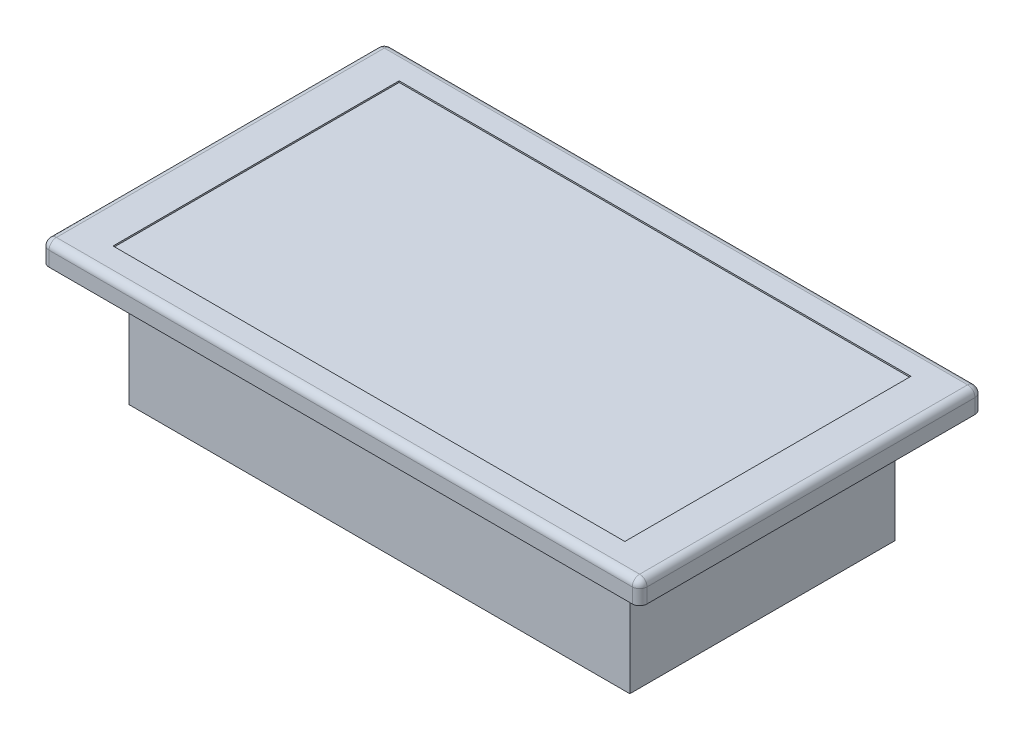
ISO-10303-21;
HEADER;
FILE_DESCRIPTION(('STEP AP214'),'2;1');
FILE_NAME('part.step','',(''),(''),'','','');
FILE_SCHEMA(('AUTOMOTIVE_DESIGN { 1 0 10303 214 1 1 1 1 }'));
ENDSEC;
DATA;
#1=APPLICATION_CONTEXT('core data for automotive mechanical design processes');
#2=APPLICATION_PROTOCOL_DEFINITION('international standard','automotive_design',2000,#1);
#3=PRODUCT_CONTEXT('',#1,'mechanical');
#4=PRODUCT('Part','Part','',(#3));
#5=PRODUCT_RELATED_PRODUCT_CATEGORY('part','',(#4));
#6=PRODUCT_DEFINITION_FORMATION('','',#4);
#7=PRODUCT_DEFINITION_CONTEXT('part definition',#1,'design');
#8=PRODUCT_DEFINITION('design','',#6,#7);
#9=PRODUCT_DEFINITION_SHAPE('','',#8);
#10=(LENGTH_UNIT() NAMED_UNIT(*) SI_UNIT(.MILLI.,.METRE.));
#11=(NAMED_UNIT(*) PLANE_ANGLE_UNIT() SI_UNIT($,.RADIAN.));
#12=(NAMED_UNIT(*) SI_UNIT($,.STERADIAN.) SOLID_ANGLE_UNIT());
#13=UNCERTAINTY_MEASURE_WITH_UNIT(LENGTH_MEASURE(1.E-05),#10,'distance_accuracy_value','');
#14=(GEOMETRIC_REPRESENTATION_CONTEXT(3) GLOBAL_UNCERTAINTY_ASSIGNED_CONTEXT((#13)) GLOBAL_UNIT_ASSIGNED_CONTEXT((#10,
#11,#12)) REPRESENTATION_CONTEXT('',''));
#15=CARTESIAN_POINT('',(0.,0.,0.));
#16=DIRECTION('',(0.,0.,1.));
#17=DIRECTION('',(1.,0.,0.));
#18=AXIS2_PLACEMENT_3D('',#15,#16,#17);
#19=CARTESIAN_POINT('',(43.18,20.32,22.86));
#20=DIRECTION('',(-1.,0.,0.));
#21=DIRECTION('',(0.,0.,1.));
#22=AXIS2_PLACEMENT_3D('',#19,#20,#21);
#23=PLANE('',#22);
#24=DIRECTION('',(0.,0.,-1.));
#25=VECTOR('',#24,1.);
#26=CARTESIAN_POINT('',(43.18,0.,22.86));
#27=LINE('',#26,#25);
#28=CARTESIAN_POINT('',(43.18,0.,22.86));
#29=VERTEX_POINT('',#28);
#30=CARTESIAN_POINT('',(43.18,0.,-22.86));
#31=VERTEX_POINT('',#30);
#32=EDGE_CURVE('E263',#29,#31,#27,.T.);
#33=ORIENTED_EDGE('',*,*,#32,.T.);
#34=DIRECTION('',(0.,-1.,0.));
#35=VECTOR('',#34,1.);
#36=CARTESIAN_POINT('',(43.18,20.32,-22.86));
#37=LINE('',#36,#35);
#38=CARTESIAN_POINT('',(43.18,20.32,-22.86));
#39=VERTEX_POINT('',#38);
#40=EDGE_CURVE('E300',#39,#31,#37,.T.);
#41=ORIENTED_EDGE('',*,*,#40,.F.);
#42=DIRECTION('',(0.,0.,-1.));
#43=VECTOR('',#42,1.);
#44=CARTESIAN_POINT('',(43.18,20.32,22.86));
#45=LINE('',#44,#43);
#46=CARTESIAN_POINT('',(43.18,20.32,22.86));
#47=VERTEX_POINT('',#46);
#48=EDGE_CURVE('E269',#47,#39,#45,.T.);
#49=ORIENTED_EDGE('',*,*,#48,.F.);
#50=DIRECTION('',(0.,-1.,0.));
#51=VECTOR('',#50,1.);
#52=CARTESIAN_POINT('',(43.18,20.32,22.86));
#53=LINE('',#52,#51);
#54=EDGE_CURVE('E282',#47,#29,#53,.T.);
#55=ORIENTED_EDGE('',*,*,#54,.T.);
#56=EDGE_LOOP('',(#33,#41,#49,#55));
#57=FACE_BOUND('',#56,.T.);
#58=ADVANCED_FACE('F37',(#57),#23,.F.);
#59=CARTESIAN_POINT('',(-43.18,20.32,-22.86));
#60=DIRECTION('',(0.,0.,1.));
#61=DIRECTION('',(1.,0.,0.));
#62=AXIS2_PLACEMENT_3D('',#59,#60,#61);
#63=PLANE('',#62);
#64=DIRECTION('',(-1.,0.,0.));
#65=VECTOR('',#64,1.);
#66=CARTESIAN_POINT('',(-43.18,0.,-22.86));
#67=LINE('',#66,#65);
#68=CARTESIAN_POINT('',(-43.18,0.,-22.86));
#69=VERTEX_POINT('',#68);
#70=EDGE_CURVE('E285',#31,#69,#67,.T.);
#71=ORIENTED_EDGE('',*,*,#70,.T.);
#72=DIRECTION('',(0.,-1.,0.));
#73=VECTOR('',#72,1.);
#74=CARTESIAN_POINT('',(-43.18,20.32,-22.86));
#75=LINE('',#74,#73);
#76=CARTESIAN_POINT('',(-43.18,20.32,-22.86));
#77=VERTEX_POINT('',#76);
#78=EDGE_CURVE('E297',#77,#69,#75,.T.);
#79=ORIENTED_EDGE('',*,*,#78,.F.);
#80=DIRECTION('',(-1.,0.,0.));
#81=VECTOR('',#80,1.);
#82=CARTESIAN_POINT('',(-43.18,20.32,-22.86));
#83=LINE('',#82,#81);
#84=EDGE_CURVE('E272',#39,#77,#83,.T.);
#85=ORIENTED_EDGE('',*,*,#84,.F.);
#86=ORIENTED_EDGE('',*,*,#40,.T.);
#87=EDGE_LOOP('',(#71,#79,#85,#86));
#88=FACE_BOUND('',#87,.T.);
#89=ADVANCED_FACE('F446',(#88),#63,.F.);
#90=CARTESIAN_POINT('',(-43.18,20.32,22.86));
#91=DIRECTION('',(1.,0.,0.));
#92=DIRECTION('',(0.,0.,-1.));
#93=AXIS2_PLACEMENT_3D('',#90,#91,#92);
#94=PLANE('',#93);
#95=DIRECTION('',(0.,0.,-1.));
#96=VECTOR('',#95,1.);
#97=CARTESIAN_POINT('',(-43.18,15.494,12.4701996636531));
#98=LINE('',#97,#96);
#99=CARTESIAN_POINT('',(-43.18,15.494,12.4701996636531));
#100=VERTEX_POINT('',#99);
#101=CARTESIAN_POINT('',(-43.18,15.494,-13.3410539706276));
#102=VERTEX_POINT('',#101);
#103=EDGE_CURVE('E240',#100,#102,#98,.T.);
#104=ORIENTED_EDGE('',*,*,#103,.F.);
#105=DIRECTION('',(0.,-1.,0.));
#106=VECTOR('',#105,1.);
#107=CARTESIAN_POINT('',(-43.18,15.494,12.4701996636531));
#108=LINE('',#107,#106);
#109=CARTESIAN_POINT('',(-43.18,0.,12.4701996636531));
#110=VERTEX_POINT('',#109);
#111=EDGE_CURVE('E260',#100,#110,#108,.T.);
#112=ORIENTED_EDGE('',*,*,#111,.T.);
#113=DIRECTION('',(0.,0.,1.));
#114=VECTOR('',#113,1.);
#115=CARTESIAN_POINT('',(-43.18,0.,22.86));
#116=LINE('',#115,#114);
#117=CARTESIAN_POINT('',(-43.18,0.,22.86));
#118=VERTEX_POINT('',#117);
#119=EDGE_CURVE('E287',#110,#118,#116,.T.);
#120=ORIENTED_EDGE('',*,*,#119,.T.);
#121=DIRECTION('',(0.,-1.,0.));
#122=VECTOR('',#121,1.);
#123=CARTESIAN_POINT('',(-43.18,20.32,22.86));
#124=LINE('',#123,#122);
#125=CARTESIAN_POINT('',(-43.18,20.32,22.86));
#126=VERTEX_POINT('',#125);
#127=EDGE_CURVE('E294',#126,#118,#124,.T.);
#128=ORIENTED_EDGE('',*,*,#127,.F.);
#129=DIRECTION('',(0.,0.,1.));
#130=VECTOR('',#129,1.);
#131=CARTESIAN_POINT('',(-43.18,20.32,22.86));
#132=LINE('',#131,#130);
#133=EDGE_CURVE('E276',#77,#126,#132,.T.);
#134=ORIENTED_EDGE('',*,*,#133,.F.);
#135=ORIENTED_EDGE('',*,*,#78,.T.);
#136=CARTESIAN_POINT('',(-43.18,0.,-13.3410539706276));
#137=VERTEX_POINT('',#136);
#138=EDGE_CURVE('E288',#69,#137,#116,.T.);
#139=ORIENTED_EDGE('',*,*,#138,.T.);
#140=DIRECTION('',(0.,-1.,0.));
#141=VECTOR('',#140,1.);
#142=CARTESIAN_POINT('',(-43.18,15.494,-13.3410539706276));
#143=LINE('',#142,#141);
#144=EDGE_CURVE('E253',#102,#137,#143,.T.);
#145=ORIENTED_EDGE('',*,*,#144,.F.);
#146=EDGE_LOOP('',(#104,#112,#120,#128,#134,#135,#139,#145));
#147=FACE_BOUND('',#146,.T.);
#148=ADVANCED_FACE('F452',(#147),#94,.F.);
#149=CARTESIAN_POINT('',(-43.18,20.32,22.86));
#150=DIRECTION('',(0.,0.,-1.));
#151=DIRECTION('',(-1.,0.,0.));
#152=AXIS2_PLACEMENT_3D('',#149,#150,#151);
#153=PLANE('',#152);
#154=DIRECTION('',(1.,0.,0.));
#155=VECTOR('',#154,1.);
#156=CARTESIAN_POINT('',(-43.18,0.,22.86));
#157=LINE('',#156,#155);
#158=EDGE_CURVE('E273',#118,#29,#157,.T.);
#159=ORIENTED_EDGE('',*,*,#158,.T.);
#160=ORIENTED_EDGE('',*,*,#54,.F.);
#161=DIRECTION('',(1.,0.,0.));
#162=VECTOR('',#161,1.);
#163=CARTESIAN_POINT('',(-43.18,20.32,22.86));
#164=LINE('',#163,#162);
#165=EDGE_CURVE('E279',#126,#47,#164,.T.);
#166=ORIENTED_EDGE('',*,*,#165,.F.);
#167=ORIENTED_EDGE('',*,*,#127,.T.);
#168=EDGE_LOOP('',(#159,#160,#166,#167));
#169=FACE_BOUND('',#168,.T.);
#170=ADVANCED_FACE('F583',(#169),#153,.F.);
#171=CARTESIAN_POINT('',(0.,0.,0.));
#172=DIRECTION('',(0.,-1.,0.));
#173=DIRECTION('',(0.,0.,-1.));
#174=AXIS2_PLACEMENT_3D('',#171,#172,#173);
#175=PLANE('',#174);
#176=DIRECTION('',(-1.,0.,0.));
#177=VECTOR('',#176,1.);
#178=CARTESIAN_POINT('',(-43.18,0.,12.4701996636531));
#179=LINE('',#178,#177);
#180=CARTESIAN_POINT('',(-29.9886261607867,0.,12.4701996636531));
#181=VERTEX_POINT('',#180);
#182=EDGE_CURVE('E244',#181,#110,#179,.T.);
#183=ORIENTED_EDGE('',*,*,#182,.F.);
#184=DIRECTION('',(0.,0.,1.));
#185=VECTOR('',#184,1.);
#186=CARTESIAN_POINT('',(-29.9886261607867,0.,12.4701996636531));
#187=LINE('',#186,#185);
#188=CARTESIAN_POINT('',(-29.9886261607867,0.,-13.3410539706276));
#189=VERTEX_POINT('',#188);
#190=EDGE_CURVE('E256',#189,#181,#187,.T.);
#191=ORIENTED_EDGE('',*,*,#190,.F.);
#192=DIRECTION('',(1.,0.,0.));
#193=VECTOR('',#192,1.);
#194=CARTESIAN_POINT('',(-43.18,0.,-13.3410539706276));
#195=LINE('',#194,#193);
#196=EDGE_CURVE('E239',#137,#189,#195,.T.);
#197=ORIENTED_EDGE('',*,*,#196,.F.);
#198=ORIENTED_EDGE('',*,*,#138,.F.);
#199=ORIENTED_EDGE('',*,*,#70,.F.);
#200=ORIENTED_EDGE('',*,*,#32,.F.);
#201=ORIENTED_EDGE('',*,*,#158,.F.);
#202=ORIENTED_EDGE('',*,*,#119,.F.);
#203=EDGE_LOOP('',(#183,#191,#197,#198,#199,#200,#201,#202));
#204=FACE_BOUND('',#203,.T.);
#205=ADVANCED_FACE('F573',(#204),#175,.T.);
#206=CARTESIAN_POINT('',(-43.18,15.494,12.4701996636531));
#207=DIRECTION('',(0.,0.,1.));
#208=DIRECTION('',(1.,0.,0.));
#209=AXIS2_PLACEMENT_3D('',#206,#207,#208);
#210=PLANE('',#209);
#211=ORIENTED_EDGE('',*,*,#182,.T.);
#212=ORIENTED_EDGE('',*,*,#111,.F.);
#213=DIRECTION('',(-1.,0.,0.));
#214=VECTOR('',#213,1.);
#215=CARTESIAN_POINT('',(-43.18,15.494,12.4701996636531));
#216=LINE('',#215,#214);
#217=CARTESIAN_POINT('',(-29.9886261607867,15.494,12.4701996636531));
#218=VERTEX_POINT('',#217);
#219=EDGE_CURVE('E250',#218,#100,#216,.T.);
#220=ORIENTED_EDGE('',*,*,#219,.F.);
#221=DIRECTION('',(0.,-1.,0.));
#222=VECTOR('',#221,1.);
#223=CARTESIAN_POINT('',(-29.9886261607867,15.494,12.4701996636531));
#224=LINE('',#223,#222);
#225=EDGE_CURVE('E264',#218,#181,#224,.T.);
#226=ORIENTED_EDGE('',*,*,#225,.T.);
#227=EDGE_LOOP('',(#211,#212,#220,#226));
#228=FACE_BOUND('',#227,.T.);
#229=ADVANCED_FACE('F569',(#228),#210,.F.);
#230=CARTESIAN_POINT('',(-29.9886261607867,15.494,12.4701996636531));
#231=DIRECTION('',(1.,0.,0.));
#232=DIRECTION('',(0.,0.,-1.));
#233=AXIS2_PLACEMENT_3D('',#230,#231,#232);
#234=PLANE('',#233);
#235=ORIENTED_EDGE('',*,*,#190,.T.);
#236=ORIENTED_EDGE('',*,*,#225,.F.);
#237=DIRECTION('',(0.,0.,1.));
#238=VECTOR('',#237,1.);
#239=CARTESIAN_POINT('',(-29.9886261607867,15.494,12.4701996636531));
#240=LINE('',#239,#238);
#241=CARTESIAN_POINT('',(-29.9886261607867,15.494,-13.3410539706276));
#242=VERTEX_POINT('',#241);
#243=EDGE_CURVE('E247',#242,#218,#240,.T.);
#244=ORIENTED_EDGE('',*,*,#243,.F.);
#245=DIRECTION('',(0.,-1.,0.));
#246=VECTOR('',#245,1.);
#247=CARTESIAN_POINT('',(-29.9886261607867,15.494,-13.3410539706276));
#248=LINE('',#247,#246);
#249=EDGE_CURVE('E266',#242,#189,#248,.T.);
#250=ORIENTED_EDGE('',*,*,#249,.T.);
#251=EDGE_LOOP('',(#235,#236,#244,#250));
#252=FACE_BOUND('',#251,.T.);
#253=ADVANCED_FACE('F572',(#252),#234,.F.);
#254=CARTESIAN_POINT('',(-43.18,15.494,-13.3410539706276));
#255=DIRECTION('',(0.,0.,-1.));
#256=DIRECTION('',(-1.,0.,0.));
#257=AXIS2_PLACEMENT_3D('',#254,#255,#256);
#258=PLANE('',#257);
#259=ORIENTED_EDGE('',*,*,#196,.T.);
#260=ORIENTED_EDGE('',*,*,#249,.F.);
#261=DIRECTION('',(1.,0.,0.));
#262=VECTOR('',#261,1.);
#263=CARTESIAN_POINT('',(-43.18,15.494,-13.3410539706276));
#264=LINE('',#263,#262);
#265=EDGE_CURVE('E243',#102,#242,#264,.T.);
#266=ORIENTED_EDGE('',*,*,#265,.F.);
#267=ORIENTED_EDGE('',*,*,#144,.T.);
#268=EDGE_LOOP('',(#259,#260,#266,#267));
#269=FACE_BOUND('',#268,.T.);
#270=ADVANCED_FACE('F567',(#269),#258,.F.);
#271=CARTESIAN_POINT('',(0.,15.494,0.));
#272=DIRECTION('',(0.,-1.,0.));
#273=DIRECTION('',(0.,0.,-1.));
#274=AXIS2_PLACEMENT_3D('',#271,#272,#273);
#275=PLANE('',#274);
#276=ORIENTED_EDGE('',*,*,#103,.T.);
#277=ORIENTED_EDGE('',*,*,#265,.T.);
#278=ORIENTED_EDGE('',*,*,#243,.T.);
#279=ORIENTED_EDGE('',*,*,#219,.T.);
#280=EDGE_LOOP('',(#276,#277,#278,#279));
#281=FACE_BOUND('',#280,.T.);
#282=ADVANCED_FACE('F556',(#281),#275,.T.);
#283=CARTESIAN_POINT('',(0.,20.32,0.));
#284=DIRECTION('',(0.,-1.,0.));
#285=DIRECTION('',(0.,0.,-1.));
#286=AXIS2_PLACEMENT_3D('',#283,#284,#285);
#287=PLANE('',#286);
#288=DIRECTION('',(0.,0.,1.));
#289=VECTOR('',#288,1.);
#290=CARTESIAN_POINT('',(-51.5655279359434,20.32,29.5497738257141));
#291=LINE('',#290,#289);
#292=CARTESIAN_POINT('',(-51.5655279359434,20.32,-28.279773825714));
#293=VERTEX_POINT('',#292);
#294=CARTESIAN_POINT('',(-51.5655279359434,20.32,28.2797738257141));
#295=VERTEX_POINT('',#294);
#296=EDGE_CURVE('E233',#293,#295,#291,.T.);
#297=ORIENTED_EDGE('',*,*,#296,.F.);
#298=CARTESIAN_POINT('',(-50.2955279359433,20.32,-28.2797738257141));
#299=DIRECTION('',(0.,-1.,0.));
#300=DIRECTION('',(0.,0.,-1.));
#301=AXIS2_PLACEMENT_3D('',#298,#299,#300);
#302=CIRCLE('',#301,1.27);
#303=CARTESIAN_POINT('',(-50.2955279359433,20.32,-29.5497738257141));
#304=VERTEX_POINT('',#303);
#305=EDGE_CURVE('E314',#293,#304,#302,.T.);
#306=ORIENTED_EDGE('',*,*,#305,.T.);
#307=DIRECTION('',(-1.,0.,0.));
#308=VECTOR('',#307,1.);
#309=CARTESIAN_POINT('',(-51.5655279359434,20.32,-29.5497738257141));
#310=LINE('',#309,#308);
#311=CARTESIAN_POINT('',(50.2955279359434,20.32,-29.5497738257141));
#312=VERTEX_POINT('',#311);
#313=EDGE_CURVE('E230',#312,#304,#310,.T.);
#314=ORIENTED_EDGE('',*,*,#313,.F.);
#315=CARTESIAN_POINT('',(50.2955279359434,20.32,-28.2797738257141));
#316=DIRECTION('',(0.,-1.,0.));
#317=DIRECTION('',(0.,0.,-1.));
#318=AXIS2_PLACEMENT_3D('',#315,#316,#317);
#319=CIRCLE('',#318,1.27);
#320=CARTESIAN_POINT('',(51.5655279359434,20.32,-28.279773825714));
#321=VERTEX_POINT('',#320);
#322=EDGE_CURVE('E312',#312,#321,#319,.T.);
#323=ORIENTED_EDGE('',*,*,#322,.T.);
#324=DIRECTION('',(0.,0.,-1.));
#325=VECTOR('',#324,1.);
#326=CARTESIAN_POINT('',(51.5655279359434,20.32,29.5497738257141));
#327=LINE('',#326,#325);
#328=CARTESIAN_POINT('',(51.5655279359434,20.32,28.2797738257141));
#329=VERTEX_POINT('',#328);
#330=EDGE_CURVE('E227',#329,#321,#327,.T.);
#331=ORIENTED_EDGE('',*,*,#330,.F.);
#332=CARTESIAN_POINT('',(50.2955279359433,20.32,28.2797738257141));
#333=DIRECTION('',(0.,-1.,0.));
#334=DIRECTION('',(0.,0.,-1.));
#335=AXIS2_PLACEMENT_3D('',#332,#333,#334);
#336=CIRCLE('',#335,1.27);
#337=CARTESIAN_POINT('',(50.2955279359434,20.32,29.5497738257141));
#338=VERTEX_POINT('',#337);
#339=EDGE_CURVE('E310',#329,#338,#336,.T.);
#340=ORIENTED_EDGE('',*,*,#339,.T.);
#341=DIRECTION('',(1.,0.,0.));
#342=VECTOR('',#341,1.);
#343=CARTESIAN_POINT('',(-51.5655279359434,20.32,29.5497738257141));
#344=LINE('',#343,#342);
#345=CARTESIAN_POINT('',(-50.2955279359433,20.32,29.5497738257141));
#346=VERTEX_POINT('',#345);
#347=EDGE_CURVE('E236',#346,#338,#344,.T.);
#348=ORIENTED_EDGE('',*,*,#347,.F.);
#349=CARTESIAN_POINT('',(-50.2955279359433,20.32,28.2797738257141));
#350=DIRECTION('',(0.,-1.,0.));
#351=DIRECTION('',(0.,0.,-1.));
#352=AXIS2_PLACEMENT_3D('',#349,#350,#351);
#353=CIRCLE('',#352,1.27);
#354=EDGE_CURVE('E308',#346,#295,#353,.T.);
#355=ORIENTED_EDGE('',*,*,#354,.T.);
#356=EDGE_LOOP('',(#297,#306,#314,#323,#331,#340,#348,#355));
#357=FACE_BOUND('',#356,.T.);
#358=ORIENTED_EDGE('',*,*,#48,.T.);
#359=ORIENTED_EDGE('',*,*,#84,.T.);
#360=ORIENTED_EDGE('',*,*,#133,.T.);
#361=ORIENTED_EDGE('',*,*,#165,.T.);
#362=EDGE_LOOP('',(#358,#359,#360,#361));
#363=FACE_BOUND('',#362,.T.);
#364=ADVANCED_FACE('F392',(#357,#363),#287,.T.);
#365=CARTESIAN_POINT('',(51.5655279359434,24.13,29.5497738257141));
#366=DIRECTION('',(-1.,0.,0.));
#367=DIRECTION('',(0.,0.,1.));
#368=AXIS2_PLACEMENT_3D('',#365,#366,#367);
#369=PLANE('',#368);
#370=DIRECTION('',(0.,-1.,0.));
#371=VECTOR('',#370,1.);
#372=CARTESIAN_POINT('',(51.5655279359434,24.13,-28.2797738257141));
#373=LINE('',#372,#371);
#374=CARTESIAN_POINT('',(51.5655279359434,22.86,-28.2797738257141));
#375=VERTEX_POINT('',#374);
#376=EDGE_CURVE('E322',#321,#375,#373,.F.);
#377=ORIENTED_EDGE('',*,*,#376,.T.);
#378=DIRECTION('',(0.,0.,-1.));
#379=VECTOR('',#378,1.);
#380=CARTESIAN_POINT('',(51.5655279359434,22.86,29.5497738257141));
#381=LINE('',#380,#379);
#382=CARTESIAN_POINT('',(51.5655279359434,22.86,28.2797738257141));
#383=VERTEX_POINT('',#382);
#384=EDGE_CURVE('E342',#375,#383,#381,.F.);
#385=ORIENTED_EDGE('',*,*,#384,.T.);
#386=DIRECTION('',(0.,-1.,0.));
#387=VECTOR('',#386,1.);
#388=CARTESIAN_POINT('',(51.5655279359434,24.13,28.2797738257141));
#389=LINE('',#388,#387);
#390=EDGE_CURVE('E320',#383,#329,#389,.T.);
#391=ORIENTED_EDGE('',*,*,#390,.T.);
#392=ORIENTED_EDGE('',*,*,#330,.T.);
#393=EDGE_LOOP('',(#377,#385,#391,#392));
#394=FACE_BOUND('',#393,.T.);
#395=ADVANCED_FACE('F555',(#394),#369,.F.);
#396=CARTESIAN_POINT('',(-51.5655279359434,24.13,-29.5497738257141));
#397=DIRECTION('',(0.,0.,1.));
#398=DIRECTION('',(1.,0.,0.));
#399=AXIS2_PLACEMENT_3D('',#396,#397,#398);
#400=PLANE('',#399);
#401=DIRECTION('',(0.,-1.,0.));
#402=VECTOR('',#401,1.);
#403=CARTESIAN_POINT('',(-50.2955279359433,24.13,-29.5497738257141));
#404=LINE('',#403,#402);
#405=CARTESIAN_POINT('',(-50.2955279359433,22.86,-29.5497738257141));
#406=VERTEX_POINT('',#405);
#407=EDGE_CURVE('E318',#304,#406,#404,.F.);
#408=ORIENTED_EDGE('',*,*,#407,.T.);
#409=DIRECTION('',(-1.,0.,0.));
#410=VECTOR('',#409,1.);
#411=CARTESIAN_POINT('',(-51.5655279359434,22.86,-29.5497738257141));
#412=LINE('',#411,#410);
#413=CARTESIAN_POINT('',(50.2955279359434,22.86,-29.5497738257141));
#414=VERTEX_POINT('',#413);
#415=EDGE_CURVE('E11',#406,#414,#412,.F.);
#416=ORIENTED_EDGE('',*,*,#415,.T.);
#417=DIRECTION('',(0.,-1.,0.));
#418=VECTOR('',#417,1.);
#419=CARTESIAN_POINT('',(50.2955279359434,24.13,-29.5497738257141));
#420=LINE('',#419,#418);
#421=EDGE_CURVE('E316',#414,#312,#420,.T.);
#422=ORIENTED_EDGE('',*,*,#421,.T.);
#423=ORIENTED_EDGE('',*,*,#313,.T.);
#424=EDGE_LOOP('',(#408,#416,#422,#423));
#425=FACE_BOUND('',#424,.T.);
#426=ADVANCED_FACE('F427',(#425),#400,.F.);
#427=CARTESIAN_POINT('',(-51.5655279359434,24.13,29.5497738257141));
#428=DIRECTION('',(1.,0.,0.));
#429=DIRECTION('',(0.,0.,-1.));
#430=AXIS2_PLACEMENT_3D('',#427,#428,#429);
#431=PLANE('',#430);
#432=DIRECTION('',(0.,-1.,0.));
#433=VECTOR('',#432,1.);
#434=CARTESIAN_POINT('',(-51.5655279359434,24.13,28.2797738257141));
#435=LINE('',#434,#433);
#436=CARTESIAN_POINT('',(-51.5655279359434,22.86,28.2797738257141));
#437=VERTEX_POINT('',#436);
#438=EDGE_CURVE('E303',#295,#437,#435,.F.);
#439=ORIENTED_EDGE('',*,*,#438,.T.);
#440=DIRECTION('',(0.,0.,1.));
#441=VECTOR('',#440,1.);
#442=CARTESIAN_POINT('',(-51.5655279359434,22.86,29.5497738257141));
#443=LINE('',#442,#441);
#444=CARTESIAN_POINT('',(-51.5655279359434,22.86,-28.2797738257141));
#445=VERTEX_POINT('',#444);
#446=EDGE_CURVE('E350',#437,#445,#443,.F.);
#447=ORIENTED_EDGE('',*,*,#446,.T.);
#448=DIRECTION('',(0.,-1.,0.));
#449=VECTOR('',#448,1.);
#450=CARTESIAN_POINT('',(-51.5655279359434,24.13,-28.2797738257141));
#451=LINE('',#450,#449);
#452=EDGE_CURVE('E306',#445,#293,#451,.T.);
#453=ORIENTED_EDGE('',*,*,#452,.T.);
#454=ORIENTED_EDGE('',*,*,#296,.T.);
#455=EDGE_LOOP('',(#439,#447,#453,#454));
#456=FACE_BOUND('',#455,.T.);
#457=ADVANCED_FACE('F388',(#456),#431,.F.);
#458=CARTESIAN_POINT('',(-51.5655279359434,24.13,29.5497738257141));
#459=DIRECTION('',(0.,0.,-1.));
#460=DIRECTION('',(-1.,0.,0.));
#461=AXIS2_PLACEMENT_3D('',#458,#459,#460);
#462=PLANE('',#461);
#463=DIRECTION('',(0.,-1.,0.));
#464=VECTOR('',#463,1.);
#465=CARTESIAN_POINT('',(50.2955279359434,24.13,29.5497738257141));
#466=LINE('',#465,#464);
#467=CARTESIAN_POINT('',(50.2955279359434,22.86,29.5497738257141));
#468=VERTEX_POINT('',#467);
#469=EDGE_CURVE('E327',#338,#468,#466,.F.);
#470=ORIENTED_EDGE('',*,*,#469,.T.);
#471=DIRECTION('',(1.,0.,0.));
#472=VECTOR('',#471,1.);
#473=CARTESIAN_POINT('',(-51.5655279359434,22.86,29.5497738257141));
#474=LINE('',#473,#472);
#475=CARTESIAN_POINT('',(-50.2955279359433,22.86,29.5497738257141));
#476=VERTEX_POINT('',#475);
#477=EDGE_CURVE('E346',#468,#476,#474,.F.);
#478=ORIENTED_EDGE('',*,*,#477,.T.);
#479=DIRECTION('',(0.,-1.,0.));
#480=VECTOR('',#479,1.);
#481=CARTESIAN_POINT('',(-50.2955279359433,24.13,29.5497738257141));
#482=LINE('',#481,#480);
#483=EDGE_CURVE('E325',#476,#346,#482,.T.);
#484=ORIENTED_EDGE('',*,*,#483,.T.);
#485=ORIENTED_EDGE('',*,*,#347,.T.);
#486=EDGE_LOOP('',(#470,#478,#484,#485));
#487=FACE_BOUND('',#486,.T.);
#488=ADVANCED_FACE('F400',(#487),#462,.F.);
#489=CARTESIAN_POINT('',(0.,24.13,0.));
#490=DIRECTION('',(0.,-1.,0.));
#491=DIRECTION('',(0.,0.,-1.));
#492=AXIS2_PLACEMENT_3D('',#489,#490,#491);
#493=PLANE('',#492);
#494=DIRECTION('',(-1.,0.,0.));
#495=VECTOR('',#494,1.);
#496=CARTESIAN_POINT('',(-44.1356100137682,24.13,-24.6731114293226));
#497=LINE('',#496,#495);
#498=CARTESIAN_POINT('',(44.1356100137682,24.13,-24.6731114293226));
#499=VERTEX_POINT('',#498);
#500=CARTESIAN_POINT('',(-44.1356100137682,24.13,-24.6731114293226));
#501=VERTEX_POINT('',#500);
#502=EDGE_CURVE('E217',#499,#501,#497,.T.);
#503=ORIENTED_EDGE('',*,*,#502,.F.);
#504=DIRECTION('',(0.,0.,-1.));
#505=VECTOR('',#504,1.);
#506=CARTESIAN_POINT('',(44.1356100137682,24.13,24.6731114293226));
#507=LINE('',#506,#505);
#508=CARTESIAN_POINT('',(44.1356100137682,24.13,24.6731114293226));
#509=VERTEX_POINT('',#508);
#510=EDGE_CURVE('E54',#509,#499,#507,.T.);
#511=ORIENTED_EDGE('',*,*,#510,.F.);
#512=DIRECTION('',(1.,0.,0.));
#513=VECTOR('',#512,1.);
#514=CARTESIAN_POINT('',(-44.1356100137682,24.13,24.6731114293226));
#515=LINE('',#514,#513);
#516=CARTESIAN_POINT('',(-44.1356100137682,24.13,24.6731114293226));
#517=VERTEX_POINT('',#516);
#518=EDGE_CURVE('E208',#517,#509,#515,.T.);
#519=ORIENTED_EDGE('',*,*,#518,.F.);
#520=DIRECTION('',(0.,0.,1.));
#521=VECTOR('',#520,1.);
#522=CARTESIAN_POINT('',(-44.1356100137682,24.13,24.6731114293226));
#523=LINE('',#522,#521);
#524=EDGE_CURVE('E211',#501,#517,#523,.T.);
#525=ORIENTED_EDGE('',*,*,#524,.F.);
#526=EDGE_LOOP('',(#503,#511,#519,#525));
#527=FACE_BOUND('',#526,.T.);
#528=DIRECTION('',(1.,0.,0.));
#529=VECTOR('',#528,1.);
#530=CARTESIAN_POINT('',(0.,24.13,28.2797738257141));
#531=LINE('',#530,#529);
#532=CARTESIAN_POINT('',(-50.2955279359433,24.13,28.2797738257141));
#533=VERTEX_POINT('',#532);
#534=CARTESIAN_POINT('',(50.2955279359433,24.13,28.2797738257141));
#535=VERTEX_POINT('',#534);
#536=EDGE_CURVE('E337',#533,#535,#531,.T.);
#537=ORIENTED_EDGE('',*,*,#536,.T.);
#538=DIRECTION('',(0.,0.,-1.));
#539=VECTOR('',#538,1.);
#540=CARTESIAN_POINT('',(50.2955279359433,24.13,0.));
#541=LINE('',#540,#539);
#542=CARTESIAN_POINT('',(50.2955279359434,24.13,-28.2797738257141));
#543=VERTEX_POINT('',#542);
#544=EDGE_CURVE('E339',#535,#543,#541,.T.);
#545=ORIENTED_EDGE('',*,*,#544,.T.);
#546=DIRECTION('',(-1.,0.,0.));
#547=VECTOR('',#546,1.);
#548=CARTESIAN_POINT('',(0.,24.13,-28.2797738257141));
#549=LINE('',#548,#547);
#550=CARTESIAN_POINT('',(-50.2955279359433,24.13,-28.2797738257141));
#551=VERTEX_POINT('',#550);
#552=EDGE_CURVE('E333',#543,#551,#549,.T.);
#553=ORIENTED_EDGE('',*,*,#552,.T.);
#554=DIRECTION('',(0.,0.,1.));
#555=VECTOR('',#554,1.);
#556=CARTESIAN_POINT('',(-50.2955279359433,24.13,0.));
#557=LINE('',#556,#555);
#558=EDGE_CURVE('E335',#551,#533,#557,.T.);
#559=ORIENTED_EDGE('',*,*,#558,.T.);
#560=EDGE_LOOP('',(#537,#545,#553,#559));
#561=FACE_BOUND('',#560,.T.);
#562=ADVANCED_FACE('F415',(#527,#561),#493,.F.);
#563=CARTESIAN_POINT('',(-50.2955279359433,24.13,-28.2797738257141));
#564=DIRECTION('',(0.,-1.,0.));
#565=DIRECTION('',(0.,0.,-1.));
#566=AXIS2_PLACEMENT_3D('',#563,#564,#565);
#567=CYLINDRICAL_SURFACE('',#566,1.27);
#568=ORIENTED_EDGE('',*,*,#452,.F.);
#569=CARTESIAN_POINT('',(-50.2955279359433,22.86,-28.2797738257141));
#570=DIRECTION('',(0.,-1.,0.));
#571=DIRECTION('',(0.,0.,-1.));
#572=AXIS2_PLACEMENT_3D('',#569,#570,#571);
#573=CIRCLE('',#572,1.27);
#574=EDGE_CURVE('E46',#445,#406,#573,.T.);
#575=ORIENTED_EDGE('',*,*,#574,.T.);
#576=ORIENTED_EDGE('',*,*,#407,.F.);
#577=ORIENTED_EDGE('',*,*,#305,.F.);
#578=EDGE_LOOP('',(#568,#575,#576,#577));
#579=FACE_BOUND('',#578,.T.);
#580=ADVANCED_FACE('F457',(#579),#567,.T.);
#581=CARTESIAN_POINT('',(50.2955279359434,24.13,-28.2797738257141));
#582=DIRECTION('',(0.,-1.,0.));
#583=DIRECTION('',(0.,0.,-1.));
#584=AXIS2_PLACEMENT_3D('',#581,#582,#583);
#585=CYLINDRICAL_SURFACE('',#584,1.27);
#586=ORIENTED_EDGE('',*,*,#421,.F.);
#587=CARTESIAN_POINT('',(50.2955279359434,22.86,-28.2797738257141));
#588=DIRECTION('',(0.,-1.,0.));
#589=DIRECTION('',(0.,0.,-1.));
#590=AXIS2_PLACEMENT_3D('',#587,#588,#589);
#591=CIRCLE('',#590,1.27);
#592=EDGE_CURVE('E330',#414,#375,#591,.T.);
#593=ORIENTED_EDGE('',*,*,#592,.T.);
#594=ORIENTED_EDGE('',*,*,#376,.F.);
#595=ORIENTED_EDGE('',*,*,#322,.F.);
#596=EDGE_LOOP('',(#586,#593,#594,#595));
#597=FACE_BOUND('',#596,.T.);
#598=ADVANCED_FACE('F431',(#597),#585,.T.);
#599=CARTESIAN_POINT('',(50.2955279359433,24.13,28.2797738257141));
#600=DIRECTION('',(0.,-1.,0.));
#601=DIRECTION('',(0.,0.,-1.));
#602=AXIS2_PLACEMENT_3D('',#599,#600,#601);
#603=CYLINDRICAL_SURFACE('',#602,1.27);
#604=ORIENTED_EDGE('',*,*,#390,.F.);
#605=CARTESIAN_POINT('',(50.2955279359433,22.86,28.2797738257141));
#606=DIRECTION('',(0.,-1.,0.));
#607=DIRECTION('',(0.,0.,-1.));
#608=AXIS2_PLACEMENT_3D('',#605,#606,#607);
#609=CIRCLE('',#608,1.27);
#610=EDGE_CURVE('E344',#383,#468,#609,.T.);
#611=ORIENTED_EDGE('',*,*,#610,.T.);
#612=ORIENTED_EDGE('',*,*,#469,.F.);
#613=ORIENTED_EDGE('',*,*,#339,.F.);
#614=EDGE_LOOP('',(#604,#611,#612,#613));
#615=FACE_BOUND('',#614,.T.);
#616=ADVANCED_FACE('F403',(#615),#603,.T.);
#617=CARTESIAN_POINT('',(-50.2955279359433,24.13,28.2797738257141));
#618=DIRECTION('',(0.,-1.,0.));
#619=DIRECTION('',(0.,0.,-1.));
#620=AXIS2_PLACEMENT_3D('',#617,#618,#619);
#621=CYLINDRICAL_SURFACE('',#620,1.27);
#622=ORIENTED_EDGE('',*,*,#483,.F.);
#623=CARTESIAN_POINT('',(-50.2955279359433,22.86,28.2797738257141));
#624=DIRECTION('',(0.,-1.,0.));
#625=DIRECTION('',(0.,0.,-1.));
#626=AXIS2_PLACEMENT_3D('',#623,#624,#625);
#627=CIRCLE('',#626,1.27);
#628=EDGE_CURVE('E348',#476,#437,#627,.T.);
#629=ORIENTED_EDGE('',*,*,#628,.T.);
#630=ORIENTED_EDGE('',*,*,#438,.F.);
#631=ORIENTED_EDGE('',*,*,#354,.F.);
#632=EDGE_LOOP('',(#622,#629,#630,#631));
#633=FACE_BOUND('',#632,.T.);
#634=ADVANCED_FACE('F385',(#633),#621,.T.);
#635=CARTESIAN_POINT('',(-50.2955279359433,22.86,28.2797738257141));
#636=DIRECTION('',(0.,-1.,0.));
#637=DIRECTION('',(0.,0.,-1.));
#638=AXIS2_PLACEMENT_3D('',#635,#636,#637);
#639=SPHERICAL_SURFACE('',#638,1.27);
#640=CARTESIAN_POINT('',(-50.2955279359433,22.86,28.2797738257141));
#641=DIRECTION('',(0.,0.,-1.));
#642=DIRECTION('',(-1.,0.,0.));
#643=AXIS2_PLACEMENT_3D('',#640,#641,#642);
#644=CIRCLE('',#643,1.27);
#645=EDGE_CURVE('E367',#437,#533,#644,.T.);
#646=ORIENTED_EDGE('',*,*,#645,.F.);
#647=ORIENTED_EDGE('',*,*,#628,.F.);
#648=CARTESIAN_POINT('',(-50.2955279359433,22.86,28.2797738257141));
#649=DIRECTION('',(1.,0.,0.));
#650=DIRECTION('',(0.,0.,-1.));
#651=AXIS2_PLACEMENT_3D('',#648,#649,#650);
#652=CIRCLE('',#651,1.27);
#653=EDGE_CURVE('E41',#533,#476,#652,.T.);
#654=ORIENTED_EDGE('',*,*,#653,.F.);
#655=EDGE_LOOP('',(#646,#647,#654));
#656=FACE_BOUND('',#655,.T.);
#657=ADVANCED_FACE('F39',(#656),#639,.T.);
#658=CARTESIAN_POINT('',(0.,22.86,28.2797738257141));
#659=DIRECTION('',(1.,0.,0.));
#660=DIRECTION('',(0.,0.,-1.));
#661=AXIS2_PLACEMENT_3D('',#658,#659,#660);
#662=CYLINDRICAL_SURFACE('',#661,1.27);
#663=ORIENTED_EDGE('',*,*,#653,.T.);
#664=ORIENTED_EDGE('',*,*,#477,.F.);
#665=CARTESIAN_POINT('',(50.2955279359433,22.86,28.2797738257141));
#666=DIRECTION('',(1.,0.,0.));
#667=DIRECTION('',(0.,0.,-1.));
#668=AXIS2_PLACEMENT_3D('',#665,#666,#667);
#669=CIRCLE('',#668,1.27);
#670=EDGE_CURVE('E365',#535,#468,#669,.T.);
#671=ORIENTED_EDGE('',*,*,#670,.F.);
#672=ORIENTED_EDGE('',*,*,#536,.F.);
#673=EDGE_LOOP('',(#663,#664,#671,#672));
#674=FACE_BOUND('',#673,.T.);
#675=ADVANCED_FACE('F378',(#674),#662,.T.);
#676=CARTESIAN_POINT('',(-50.2955279359433,22.86,0.));
#677=DIRECTION('',(0.,0.,1.));
#678=DIRECTION('',(1.,0.,0.));
#679=AXIS2_PLACEMENT_3D('',#676,#677,#678);
#680=CYLINDRICAL_SURFACE('',#679,1.27);
#681=ORIENTED_EDGE('',*,*,#645,.T.);
#682=ORIENTED_EDGE('',*,*,#558,.F.);
#683=CARTESIAN_POINT('',(-50.2955279359433,22.86,-28.2797738257141));
#684=DIRECTION('',(0.,0.,-1.));
#685=DIRECTION('',(-1.,0.,0.));
#686=AXIS2_PLACEMENT_3D('',#683,#684,#685);
#687=CIRCLE('',#686,1.27);
#688=EDGE_CURVE('E362',#445,#551,#687,.T.);
#689=ORIENTED_EDGE('',*,*,#688,.F.);
#690=ORIENTED_EDGE('',*,*,#446,.F.);
#691=EDGE_LOOP('',(#681,#682,#689,#690));
#692=FACE_BOUND('',#691,.T.);
#693=ADVANCED_FACE('F417',(#692),#680,.T.);
#694=CARTESIAN_POINT('',(50.2955279359433,22.86,28.2797738257141));
#695=DIRECTION('',(0.,-1.,0.));
#696=DIRECTION('',(0.,0.,-1.));
#697=AXIS2_PLACEMENT_3D('',#694,#695,#696);
#698=SPHERICAL_SURFACE('',#697,1.27);
#699=ORIENTED_EDGE('',*,*,#670,.T.);
#700=ORIENTED_EDGE('',*,*,#610,.F.);
#701=CARTESIAN_POINT('',(50.2955279359433,22.86,28.2797738257141));
#702=DIRECTION('',(0.,0.,-1.));
#703=DIRECTION('',(-1.,0.,0.));
#704=AXIS2_PLACEMENT_3D('',#701,#702,#703);
#705=CIRCLE('',#704,1.27);
#706=EDGE_CURVE('E359',#535,#383,#705,.T.);
#707=ORIENTED_EDGE('',*,*,#706,.F.);
#708=EDGE_LOOP('',(#699,#700,#707));
#709=FACE_BOUND('',#708,.T.);
#710=ADVANCED_FACE('F407',(#709),#698,.T.);
#711=CARTESIAN_POINT('',(-50.2955279359433,22.86,-28.2797738257141));
#712=DIRECTION('',(0.,-1.,0.));
#713=DIRECTION('',(0.,0.,-1.));
#714=AXIS2_PLACEMENT_3D('',#711,#712,#713);
#715=SPHERICAL_SURFACE('',#714,1.27);
#716=ORIENTED_EDGE('',*,*,#574,.F.);
#717=ORIENTED_EDGE('',*,*,#688,.T.);
#718=CARTESIAN_POINT('',(-50.2955279359433,22.86,-28.2797738257141));
#719=DIRECTION('',(1.,0.,0.));
#720=DIRECTION('',(0.,0.,-1.));
#721=AXIS2_PLACEMENT_3D('',#718,#719,#720);
#722=CIRCLE('',#721,1.27);
#723=EDGE_CURVE('E356',#406,#551,#722,.T.);
#724=ORIENTED_EDGE('',*,*,#723,.F.);
#725=EDGE_LOOP('',(#716,#717,#724));
#726=FACE_BOUND('',#725,.T.);
#727=ADVANCED_FACE('F420',(#726),#715,.T.);
#728=CARTESIAN_POINT('',(50.2955279359433,22.86,0.));
#729=DIRECTION('',(0.,0.,-1.));
#730=DIRECTION('',(-1.,0.,0.));
#731=AXIS2_PLACEMENT_3D('',#728,#729,#730);
#732=CYLINDRICAL_SURFACE('',#731,1.27);
#733=ORIENTED_EDGE('',*,*,#706,.T.);
#734=ORIENTED_EDGE('',*,*,#384,.F.);
#735=CARTESIAN_POINT('',(50.2955279359433,22.86,-28.2797738257141));
#736=DIRECTION('',(0.,0.,-1.));
#737=DIRECTION('',(-1.,0.,0.));
#738=AXIS2_PLACEMENT_3D('',#735,#736,#737);
#739=CIRCLE('',#738,1.27);
#740=EDGE_CURVE('E354',#543,#375,#739,.T.);
#741=ORIENTED_EDGE('',*,*,#740,.F.);
#742=ORIENTED_EDGE('',*,*,#544,.F.);
#743=EDGE_LOOP('',(#733,#734,#741,#742));
#744=FACE_BOUND('',#743,.T.);
#745=ADVANCED_FACE('F411',(#744),#732,.T.);
#746=CARTESIAN_POINT('',(0.,22.86,-28.2797738257141));
#747=DIRECTION('',(-1.,0.,0.));
#748=DIRECTION('',(0.,0.,1.));
#749=AXIS2_PLACEMENT_3D('',#746,#747,#748);
#750=CYLINDRICAL_SURFACE('',#749,1.27);
#751=ORIENTED_EDGE('',*,*,#723,.T.);
#752=ORIENTED_EDGE('',*,*,#552,.F.);
#753=CARTESIAN_POINT('',(50.2955279359434,22.86,-28.2797738257141));
#754=DIRECTION('',(1.,0.,0.));
#755=DIRECTION('',(0.,0.,-1.));
#756=AXIS2_PLACEMENT_3D('',#753,#754,#755);
#757=CIRCLE('',#756,1.27);
#758=EDGE_CURVE('E223',#414,#543,#757,.T.);
#759=ORIENTED_EDGE('',*,*,#758,.F.);
#760=ORIENTED_EDGE('',*,*,#415,.F.);
#761=EDGE_LOOP('',(#751,#752,#759,#760));
#762=FACE_BOUND('',#761,.T.);
#763=ADVANCED_FACE('F423',(#762),#750,.T.);
#764=CARTESIAN_POINT('',(50.2955279359434,22.86,-28.2797738257141));
#765=DIRECTION('',(0.,-1.,0.));
#766=DIRECTION('',(0.,0.,-1.));
#767=AXIS2_PLACEMENT_3D('',#764,#765,#766);
#768=SPHERICAL_SURFACE('',#767,1.27);
#769=ORIENTED_EDGE('',*,*,#740,.T.);
#770=ORIENTED_EDGE('',*,*,#592,.F.);
#771=ORIENTED_EDGE('',*,*,#758,.T.);
#772=EDGE_LOOP('',(#769,#770,#771));
#773=FACE_BOUND('',#772,.T.);
#774=ADVANCED_FACE('F434',(#773),#768,.T.);
#775=CARTESIAN_POINT('',(44.1356100137682,23.876,24.6731114293226));
#776=DIRECTION('',(1.,0.,0.));
#777=DIRECTION('',(0.,0.,-1.));
#778=AXIS2_PLACEMENT_3D('',#775,#776,#777);
#779=PLANE('',#778);
#780=ORIENTED_EDGE('',*,*,#510,.T.);
#781=DIRECTION('',(0.,1.,0.));
#782=VECTOR('',#781,1.);
#783=CARTESIAN_POINT('',(44.1356100137682,23.876,-24.6731114293226));
#784=LINE('',#783,#782);
#785=CARTESIAN_POINT('',(44.1356100137682,23.876,-24.6731114293226));
#786=VERTEX_POINT('',#785);
#787=EDGE_CURVE('E186',#786,#499,#784,.T.);
#788=ORIENTED_EDGE('',*,*,#787,.F.);
#789=DIRECTION('',(0.,0.,-1.));
#790=VECTOR('',#789,1.);
#791=CARTESIAN_POINT('',(44.1356100137682,23.876,24.6731114293226));
#792=LINE('',#791,#790);
#793=CARTESIAN_POINT('',(44.1356100137682,23.876,24.6731114293226));
#794=VERTEX_POINT('',#793);
#795=EDGE_CURVE('E190',#794,#786,#792,.T.);
#796=ORIENTED_EDGE('',*,*,#795,.F.);
#797=DIRECTION('',(0.,1.,0.));
#798=VECTOR('',#797,1.);
#799=CARTESIAN_POINT('',(44.1356100137682,23.876,24.6731114293226));
#800=LINE('',#799,#798);
#801=EDGE_CURVE('E221',#794,#509,#800,.T.);
#802=ORIENTED_EDGE('',*,*,#801,.T.);
#803=EDGE_LOOP('',(#780,#788,#796,#802));
#804=FACE_BOUND('',#803,.T.);
#805=ADVANCED_FACE('F188',(#804),#779,.F.);
#806=CARTESIAN_POINT('',(-44.1356100137682,23.876,24.6731114293226));
#807=DIRECTION('',(0.,0.,1.));
#808=DIRECTION('',(1.,0.,0.));
#809=AXIS2_PLACEMENT_3D('',#806,#807,#808);
#810=PLANE('',#809);
#811=ORIENTED_EDGE('',*,*,#518,.T.);
#812=ORIENTED_EDGE('',*,*,#801,.F.);
#813=DIRECTION('',(1.,0.,0.));
#814=VECTOR('',#813,1.);
#815=CARTESIAN_POINT('',(-44.1356100137682,23.876,24.6731114293226));
#816=LINE('',#815,#814);
#817=CARTESIAN_POINT('',(-44.1356100137682,23.876,24.6731114293226));
#818=VERTEX_POINT('',#817);
#819=EDGE_CURVE('E196',#818,#794,#816,.T.);
#820=ORIENTED_EDGE('',*,*,#819,.F.);
#821=DIRECTION('',(0.,1.,0.));
#822=VECTOR('',#821,1.);
#823=CARTESIAN_POINT('',(-44.1356100137682,23.876,24.6731114293226));
#824=LINE('',#823,#822);
#825=EDGE_CURVE('E224',#818,#517,#824,.T.);
#826=ORIENTED_EDGE('',*,*,#825,.T.);
#827=EDGE_LOOP('',(#811,#812,#820,#826));
#828=FACE_BOUND('',#827,.T.);
#829=ADVANCED_FACE('F441',(#828),#810,.F.);
#830=CARTESIAN_POINT('',(-44.1356100137682,23.876,24.6731114293226));
#831=DIRECTION('',(-1.,0.,0.));
#832=DIRECTION('',(0.,0.,1.));
#833=AXIS2_PLACEMENT_3D('',#830,#831,#832);
#834=PLANE('',#833);
#835=ORIENTED_EDGE('',*,*,#524,.T.);
#836=ORIENTED_EDGE('',*,*,#825,.F.);
#837=DIRECTION('',(0.,0.,1.));
#838=VECTOR('',#837,1.);
#839=CARTESIAN_POINT('',(-44.1356100137682,23.876,24.6731114293226));
#840=LINE('',#839,#838);
#841=CARTESIAN_POINT('',(-44.1356100137682,23.876,-24.6731114293226));
#842=VERTEX_POINT('',#841);
#843=EDGE_CURVE('E204',#842,#818,#840,.T.);
#844=ORIENTED_EDGE('',*,*,#843,.F.);
#845=DIRECTION('',(0.,1.,0.));
#846=VECTOR('',#845,1.);
#847=CARTESIAN_POINT('',(-44.1356100137682,23.876,-24.6731114293226));
#848=LINE('',#847,#846);
#849=EDGE_CURVE('E195',#842,#501,#848,.T.);
#850=ORIENTED_EDGE('',*,*,#849,.T.);
#851=EDGE_LOOP('',(#835,#836,#844,#850));
#852=FACE_BOUND('',#851,.T.);
#853=ADVANCED_FACE('F520',(#852),#834,.F.);
#854=CARTESIAN_POINT('',(-44.1356100137682,23.876,-24.6731114293226));
#855=DIRECTION('',(0.,0.,-1.));
#856=DIRECTION('',(-1.,0.,0.));
#857=AXIS2_PLACEMENT_3D('',#854,#855,#856);
#858=PLANE('',#857);
#859=ORIENTED_EDGE('',*,*,#502,.T.);
#860=ORIENTED_EDGE('',*,*,#849,.F.);
#861=DIRECTION('',(-1.,0.,0.));
#862=VECTOR('',#861,1.);
#863=CARTESIAN_POINT('',(-44.1356100137682,23.876,-24.6731114293226));
#864=LINE('',#863,#862);
#865=EDGE_CURVE('E199',#786,#842,#864,.T.);
#866=ORIENTED_EDGE('',*,*,#865,.F.);
#867=ORIENTED_EDGE('',*,*,#787,.T.);
#868=EDGE_LOOP('',(#859,#860,#866,#867));
#869=FACE_BOUND('',#868,.T.);
#870=ADVANCED_FACE('F200',(#869),#858,.F.);
#871=CARTESIAN_POINT('',(0.,23.876,0.));
#872=DIRECTION('',(0.,-1.,0.));
#873=DIRECTION('',(0.,0.,-1.));
#874=AXIS2_PLACEMENT_3D('',#871,#872,#873);
#875=PLANE('',#874);
#876=ORIENTED_EDGE('',*,*,#795,.T.);
#877=ORIENTED_EDGE('',*,*,#865,.T.);
#878=ORIENTED_EDGE('',*,*,#843,.T.);
#879=ORIENTED_EDGE('',*,*,#819,.T.);
#880=EDGE_LOOP('',(#876,#877,#878,#879));
#881=FACE_BOUND('',#880,.T.);
#882=ADVANCED_FACE('F206',(#881),#875,.F.);
#883=CLOSED_SHELL('',(#58,#89,#148,#170,#205,#229,#253,#270,#282,#364,#395,#426,#457,#488,#562,
#580,#598,#616,#634,#657,#675,#693,#710,#727,#745,#763,#774,#805,#829,#853,#870,#882));
#884=MANIFOLD_SOLID_BREP('B2',#883);
#885=ADVANCED_BREP_SHAPE_REPRESENTATION('',(#18,#884),#14);
#886=SHAPE_DEFINITION_REPRESENTATION(#9,#885);
ENDSEC;
END-ISO-10303-21;
